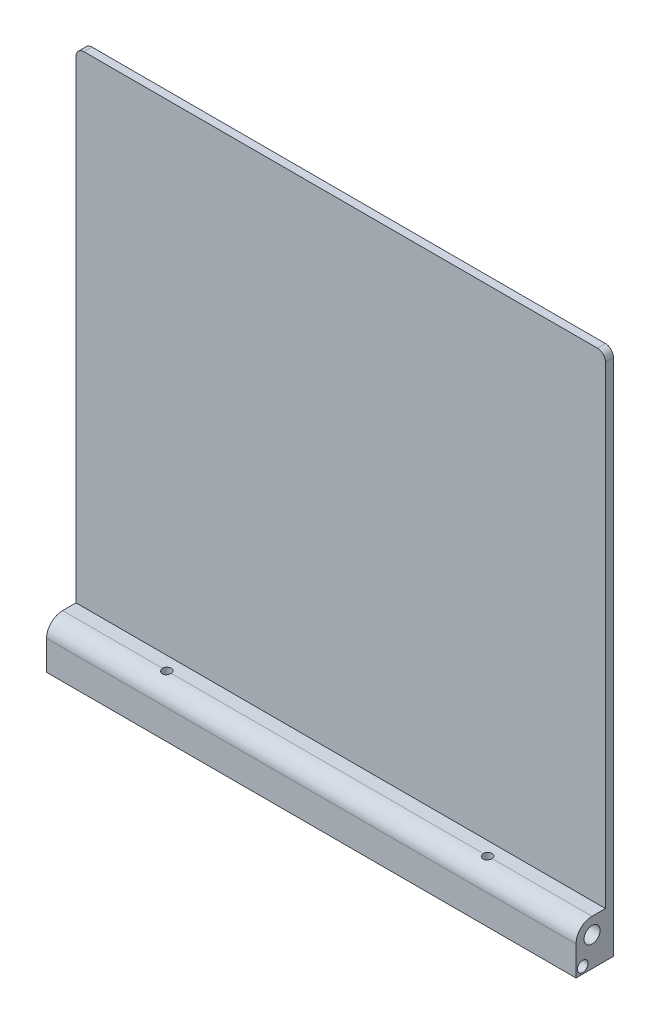
ISO-10303-21;
HEADER;
FILE_DESCRIPTION(('STEP AP214'),'2;1');
FILE_NAME('part.step','',(''),(''),'','','');
FILE_SCHEMA(('AUTOMOTIVE_DESIGN { 1 0 10303 214 1 1 1 1 }'));
ENDSEC;
DATA;
#1=APPLICATION_CONTEXT('core data for automotive mechanical design processes');
#2=APPLICATION_PROTOCOL_DEFINITION('international standard','automotive_design',2000,#1);
#3=PRODUCT_CONTEXT('',#1,'mechanical');
#4=PRODUCT('Part','Part','',(#3));
#5=PRODUCT_RELATED_PRODUCT_CATEGORY('part','',(#4));
#6=PRODUCT_DEFINITION_FORMATION('','',#4);
#7=PRODUCT_DEFINITION_CONTEXT('part definition',#1,'design');
#8=PRODUCT_DEFINITION('design','',#6,#7);
#9=PRODUCT_DEFINITION_SHAPE('','',#8);
#10=(LENGTH_UNIT() NAMED_UNIT(*) SI_UNIT(.MILLI.,.METRE.));
#11=(NAMED_UNIT(*) PLANE_ANGLE_UNIT() SI_UNIT($,.RADIAN.));
#12=(NAMED_UNIT(*) SI_UNIT($,.STERADIAN.) SOLID_ANGLE_UNIT());
#13=UNCERTAINTY_MEASURE_WITH_UNIT(LENGTH_MEASURE(1.E-05),#10,'distance_accuracy_value','');
#14=(GEOMETRIC_REPRESENTATION_CONTEXT(3) GLOBAL_UNCERTAINTY_ASSIGNED_CONTEXT((#13)) GLOBAL_UNIT_ASSIGNED_CONTEXT((#10,
#11,#12)) REPRESENTATION_CONTEXT('',''));
#15=CARTESIAN_POINT('',(0.,0.,0.));
#16=DIRECTION('',(0.,0.,1.));
#17=DIRECTION('',(1.,0.,0.));
#18=AXIS2_PLACEMENT_3D('',#15,#16,#17);
#19=CARTESIAN_POINT('',(216.439088914586,-6.,8.00000000000001));
#20=DIRECTION('',(-1.,0.,0.));
#21=DIRECTION('',(0.,0.,1.));
#22=AXIS2_PLACEMENT_3D('',#19,#20,#21);
#23=CYLINDRICAL_SURFACE('',#22,6.);
#24=CARTESIAN_POINT('',(0.,-6.,8.00000000000001));
#25=DIRECTION('',(-1.,0.,0.));
#26=DIRECTION('',(0.,0.,1.));
#27=AXIS2_PLACEMENT_3D('',#24,#25,#26);
#28=CIRCLE('',#27,6.);
#29=CARTESIAN_POINT('',(0.,-6.,14.));
#30=VERTEX_POINT('',#29);
#31=CARTESIAN_POINT('',(0.,0.,8.00000000000001));
#32=VERTEX_POINT('',#31);
#33=EDGE_CURVE('E251',#30,#32,#28,.T.);
#34=ORIENTED_EDGE('',*,*,#33,.F.);
#35=DIRECTION('',(-1.,0.,0.));
#36=VECTOR('',#35,1.);
#37=CARTESIAN_POINT('',(215.804493814765,-6.,14.));
#38=LINE('',#37,#36);
#39=CARTESIAN_POINT('',(198.,-6.,14.));
#40=VERTEX_POINT('',#39);
#41=EDGE_CURVE('E157',#40,#30,#38,.T.);
#42=ORIENTED_EDGE('',*,*,#41,.F.);
#43=CARTESIAN_POINT('',(198.,-6.,8.00000000000001));
#44=DIRECTION('',(-1.,0.,0.));
#45=DIRECTION('',(0.,0.,1.));
#46=AXIS2_PLACEMENT_3D('',#43,#44,#45);
#47=CIRCLE('',#46,6.);
#48=CARTESIAN_POINT('',(198.,0.,8.00000000000001));
#49=VERTEX_POINT('',#48);
#50=EDGE_CURVE('E245',#49,#40,#47,.F.);
#51=ORIENTED_EDGE('',*,*,#50,.F.);
#52=DIRECTION('',(-1.,0.,0.));
#53=VECTOR('',#52,1.);
#54=CARTESIAN_POINT('',(216.439088914586,0.,8.00000000000001));
#55=LINE('',#54,#53);
#56=CARTESIAN_POINT('',(160.650000000001,0.,8.00000000000001));
#57=VERTEX_POINT('',#56);
#58=EDGE_CURVE('E242',#49,#57,#55,.T.);
#59=ORIENTED_EDGE('',*,*,#58,.T.);
#60=CARTESIAN_POINT('',(157.350000000001,0.,8.00000000000001));
#61=CARTESIAN_POINT('',(157.349999349085,2.83240331525326E-06,8.04551183743026));
#62=CARTESIAN_POINT('',(157.351884234343,-0.00051846048665869,8.09100107677822));
#63=CARTESIAN_POINT('',(157.359397498983,-0.00257911264489082,8.18163817566653));
#64=CARTESIAN_POINT('',(157.365025218428,-0.00411829243840994,8.22678609396976));
#65=CARTESIAN_POINT('',(157.387437170605,-0.0102054338238871,8.36102768941026));
#66=CARTESIAN_POINT('',(157.409750588948,-0.0162233608017773,8.44919687050818));
#67=CARTESIAN_POINT('',(157.468384887187,-0.0315367611303123,8.62036467096521));
#68=CARTESIAN_POINT('',(157.504703903707,-0.0408317984636648,8.70336397644498));
#69=CARTESIAN_POINT('',(157.590259066331,-0.0617214090138262,8.86212631575357));
#70=CARTESIAN_POINT('',(157.639499218172,-0.0733166950681179,8.93788709558314));
#71=CARTESIAN_POINT('',(157.750760082946,-0.0978733295873065,9.08183007412049));
#72=CARTESIAN_POINT('',(157.813037186403,-0.110859042674939,9.14980985106851));
#73=CARTESIAN_POINT('',(157.948062331658,-0.136580582149559,9.274509565284));
#74=CARTESIAN_POINT('',(158.020812501585,-0.149316357149979,9.33122720849796));
#75=CARTESIAN_POINT('',(158.176363937181,-0.173347848442895,9.43279702883052));
#76=CARTESIAN_POINT('',(158.259325575279,-0.184612739634141,9.47741156065146));
#77=CARTESIAN_POINT('',(158.431928495845,-0.204064514089823,9.55197519180417));
#78=CARTESIAN_POINT('',(158.52156812545,-0.212252155988373,9.58192790626441));
#79=CARTESIAN_POINT('',(158.702723669719,-0.224369523897705,9.6256072656766));
#80=CARTESIAN_POINT('',(158.794143565323,-0.228396320159786,9.63970453906489));
#81=CARTESIAN_POINT('',(158.978134683162,-0.232025819556786,9.65242893409797));
#82=CARTESIAN_POINT('',(159.070705697897,-0.231629308806205,9.65105880462439));
#83=CARTESIAN_POINT('',(159.251445891706,-0.226543505517346,9.633180176991));
#84=CARTESIAN_POINT('',(159.339664025129,-0.221982542531215,9.61712420419922));
#85=CARTESIAN_POINT('',(159.512102379451,-0.209287794161005,9.57105615336394));
#86=CARTESIAN_POINT('',(159.596322301858,-0.201153742485473,9.54104303512698));
#87=CARTESIAN_POINT('',(159.759537406641,-0.182118903946736,9.46755225342328));
#88=CARTESIAN_POINT('',(159.838458524575,-0.171186357736752,9.42391867613945));
#89=CARTESIAN_POINT('',(159.988014411749,-0.147803266958054,9.32453481884693));
#90=CARTESIAN_POINT('',(160.058647606775,-0.135352434918037,9.26878224266575));
#91=CARTESIAN_POINT('',(160.192198365522,-0.109805919208269,9.14445251792482));
#92=CARTESIAN_POINT('',(160.254763319287,-0.0967028481371507,9.0754976093337));
#93=CARTESIAN_POINT('',(160.367529620892,-0.071711448314673,8.9278944479472));
#94=CARTESIAN_POINT('',(160.417727830988,-0.0598234282980691,8.8492437426718));
#95=CARTESIAN_POINT('',(160.504509221461,-0.0385183140127452,8.68390037906992));
#96=CARTESIAN_POINT('',(160.541017767157,-0.0291148450900398,8.59716676566456));
#97=CARTESIAN_POINT('',(160.598787113738,-0.0139468034544592,8.41852284388635));
#98=CARTESIAN_POINT('',(160.620070206868,-0.00817691215167189,8.32662031723512));
#99=CARTESIAN_POINT('',(160.638916115859,-0.00304028656834387,8.19491132244159));
#100=CARTESIAN_POINT('',(160.643072895872,-0.00190195021588287,8.15602229238801));
#101=CARTESIAN_POINT('',(160.648611935512,-0.00038205775457785,8.07809516769988));
#102=CARTESIAN_POINT('',(160.649998635571,7.09518498061268E-07,8.03905741229831));
#103=CARTESIAN_POINT('',(160.650000000001,0.,8.00000000000001));
#104=B_SPLINE_CURVE_WITH_KNOTS('',3,(#60,#61,#62,#63,#64,#65,#66,#67,#68,#69,#70,#71,#72,#73,
#74,#75,#76,#77,#78,#79,#80,#81,#82,#83,#84,#85,#86,#87,#88,#89,#90,#91,#92,#93,#94,#95,#96,#97,
#98,#99,#100,#101,#102,#103),.UNSPECIFIED.,.F.,.F.,(4,2,2,2,2,2,2,2,2,2,2,2,2,2,2,2,2,2,2,2,2,
4),(0.,0.136449081071721,0.272874109730397,0.544902077857917,0.816893866500146,1.08897007630706,
1.36700763137525,1.64510176366077,1.92831518768273,2.21145874524367,2.48783642218913,
2.76416498180287,3.03225558699577,3.30036617555843,3.57166593196946,3.84301713610122,
4.12378054549448,4.40461511819304,4.6869592488856,4.96888913646518,5.0861840746135,
5.20329083781439),.UNSPECIFIED.);
#105=CARTESIAN_POINT('',(157.350000000001,0.,8.00000000000001));
#106=VERTEX_POINT('',#105);
#107=EDGE_CURVE('E165',#106,#57,#104,.T.);
#108=ORIENTED_EDGE('',*,*,#107,.F.);
#109=CARTESIAN_POINT('',(40.6500000000014,0.,8.00000000000001));
#110=VERTEX_POINT('',#109);
#111=EDGE_CURVE('E246',#106,#110,#55,.T.);
#112=ORIENTED_EDGE('',*,*,#111,.T.);
#113=CARTESIAN_POINT('',(37.3500000000014,0.,8.00000000000001));
#114=CARTESIAN_POINT('',(37.3499993490854,2.83240331461787E-06,8.04551183743026));
#115=CARTESIAN_POINT('',(37.3518842343427,-0.000518460486659278,8.09100107677822));
#116=CARTESIAN_POINT('',(37.3593974989832,-0.00257911264489091,8.18163817566652));
#117=CARTESIAN_POINT('',(37.3650252184275,-0.00411829243840962,8.22678609396975));
#118=CARTESIAN_POINT('',(37.3874371706049,-0.0102054338238863,8.36102768941026));
#119=CARTESIAN_POINT('',(37.4097505889485,-0.0162233608017771,8.44919687050817));
#120=CARTESIAN_POINT('',(37.4683848871869,-0.0315367611303126,8.6203646709652));
#121=CARTESIAN_POINT('',(37.5047039037067,-0.0408317984636649,8.70336397644497));
#122=CARTESIAN_POINT('',(37.590259066331,-0.0617214090138252,8.86212631575357));
#123=CARTESIAN_POINT('',(37.6394992181721,-0.0733166950681161,8.93788709558313));
#124=CARTESIAN_POINT('',(37.7507600829463,-0.0978733295873048,9.08183007412049));
#125=CARTESIAN_POINT('',(37.813037186403,-0.110859042674939,9.14980985106851));
#126=CARTESIAN_POINT('',(37.948062331658,-0.136580582149559,9.274509565284));
#127=CARTESIAN_POINT('',(38.0208125015846,-0.149316357149978,9.33122720849795));
#128=CARTESIAN_POINT('',(38.1763639371807,-0.173347848442894,9.43279702883052));
#129=CARTESIAN_POINT('',(38.2593255752785,-0.18461273963414,9.47741156065146));
#130=CARTESIAN_POINT('',(38.4319284958445,-0.204064514089823,9.55197519180417));
#131=CARTESIAN_POINT('',(38.5215681254497,-0.212252155988372,9.58192790626441));
#132=CARTESIAN_POINT('',(38.7027236697185,-0.224369523897704,9.62560726567659));
#133=CARTESIAN_POINT('',(38.7941435653231,-0.228396320159785,9.63970453906489));
#134=CARTESIAN_POINT('',(38.9781346831618,-0.232025819556785,9.65242893409797));
#135=CARTESIAN_POINT('',(39.0707056978969,-0.231629308806204,9.65105880462439));
#136=CARTESIAN_POINT('',(39.2514458917058,-0.226543505517347,9.633180176991));
#137=CARTESIAN_POINT('',(39.3396640251285,-0.221982542531216,9.61712420419922));
#138=CARTESIAN_POINT('',(39.5121023794512,-0.209287794161006,9.57105615336395));
#139=CARTESIAN_POINT('',(39.5963223018582,-0.201153742485473,9.54104303512699));
#140=CARTESIAN_POINT('',(39.7595374066407,-0.182118903946737,9.46755225342328));
#141=CARTESIAN_POINT('',(39.8384585245753,-0.171186357736753,9.42391867613945));
#142=CARTESIAN_POINT('',(39.9880144117491,-0.147803266958057,9.32453481884694));
#143=CARTESIAN_POINT('',(40.0586476067748,-0.135352434918041,9.26878224266577));
#144=CARTESIAN_POINT('',(40.1921983655217,-0.109805919208274,9.14445251792485));
#145=CARTESIAN_POINT('',(40.254763319287,-0.0967028481371569,9.07549760933374));
#146=CARTESIAN_POINT('',(40.3675296208921,-0.0717114483146789,8.92789444794724));
#147=CARTESIAN_POINT('',(40.4177278309883,-0.0598234282980738,8.84924374267183));
#148=CARTESIAN_POINT('',(40.5045092214608,-0.0385183140127488,8.68390037906995));
#149=CARTESIAN_POINT('',(40.5410177671574,-0.0291148450900436,8.59716676566459));
#150=CARTESIAN_POINT('',(40.5987871137379,-0.0139468034544617,8.41852284388639));
#151=CARTESIAN_POINT('',(40.6200702068679,-0.00817691215167273,8.32662031723515));
#152=CARTESIAN_POINT('',(40.6389161158588,-0.00304028656834475,8.19491132244162));
#153=CARTESIAN_POINT('',(40.6430728958722,-0.00190195021588404,8.15602229238803));
#154=CARTESIAN_POINT('',(40.6486119355117,-0.000382057754579208,8.0780951676999));
#155=CARTESIAN_POINT('',(40.6499986355711,7.09518496788292E-07,8.03905741229832));
#156=CARTESIAN_POINT('',(40.6500000000014,0.,8.00000000000001));
#157=B_SPLINE_CURVE_WITH_KNOTS('',3,(#113,#114,#115,#116,#117,#118,#119,#120,#121,#122,#123,
#124,#125,#126,#127,#128,#129,#130,#131,#132,#133,#134,#135,#136,#137,#138,#139,#140,#141,#142,
#143,#144,#145,#146,#147,#148,#149,#150,#151,#152,#153,#154,#155,#156),.UNSPECIFIED.,.F.,.F.,(4,
2,2,2,2,2,2,2,2,2,2,2,2,2,2,2,2,2,2,2,2,4),(0.,0.136449081071717,0.272874109730394,
0.544902077857913,0.816893866500141,1.08897007630705,1.36700763137524,1.64510176366078,
1.92831518768272,2.21145874524365,2.4878364221891,2.76416498180281,3.03225558699575,
3.30036617555841,3.57166593196943,3.84301713610118,4.12378054549441,4.40461511819298,
4.68695924888555,4.96888913646513,5.08618407461346,5.20329083781438),.UNSPECIFIED.);
#158=CARTESIAN_POINT('',(37.3500000000014,0.,8.00000000000001));
#159=VERTEX_POINT('',#158);
#160=EDGE_CURVE('E174',#159,#110,#157,.T.);
#161=ORIENTED_EDGE('',*,*,#160,.F.);
#162=EDGE_CURVE('E247',#159,#32,#55,.T.);
#163=ORIENTED_EDGE('',*,*,#162,.T.);
#164=EDGE_LOOP('',(#34,#42,#51,#59,#108,#112,#161,#163));
#165=FACE_BOUND('',#164,.T.);
#166=ADVANCED_FACE('F36',(#165),#23,.T.);
#167=CARTESIAN_POINT('',(0.,0.,3.));
#168=DIRECTION('',(1.,0.,0.));
#169=DIRECTION('',(0.,0.,-1.));
#170=AXIS2_PLACEMENT_3D('',#167,#168,#169);
#171=PLANE('',#170);
#172=CARTESIAN_POINT('',(0.,-14.5,11.5));
#173=DIRECTION('',(1.,0.,0.));
#174=DIRECTION('',(0.,0.,-1.));
#175=AXIS2_PLACEMENT_3D('',#172,#173,#174);
#176=CIRCLE('',#175,2.);
#177=CARTESIAN_POINT('',(0.,-14.5,9.50000000000001));
#178=VERTEX_POINT('',#177);
#179=EDGE_CURVE('E431',#178,#178,#176,.T.);
#180=ORIENTED_EDGE('',*,*,#179,.T.);
#181=EDGE_LOOP('',(#180));
#182=FACE_BOUND('',#181,.T.);
#183=CARTESIAN_POINT('',(0.,-6.,8.00000000000001));
#184=DIRECTION('',(-1.,0.,0.));
#185=DIRECTION('',(0.,0.,1.));
#186=AXIS2_PLACEMENT_3D('',#183,#184,#185);
#187=CIRCLE('',#186,3.);
#188=CARTESIAN_POINT('',(0.,-6.,11.));
#189=VERTEX_POINT('',#188);
#190=EDGE_CURVE('E253',#189,#189,#187,.T.);
#191=ORIENTED_EDGE('',*,*,#190,.F.);
#192=EDGE_LOOP('',(#191));
#193=FACE_BOUND('',#192,.T.);
#194=DIRECTION('',(0.,-1.,0.));
#195=VECTOR('',#194,1.);
#196=CARTESIAN_POINT('',(0.,0.,0.));
#197=LINE('',#196,#195);
#198=CARTESIAN_POINT('',(0.,177.,0.));
#199=VERTEX_POINT('',#198);
#200=CARTESIAN_POINT('',(0.,-17.,0.));
#201=VERTEX_POINT('',#200);
#202=EDGE_CURVE('E121',#199,#201,#197,.T.);
#203=ORIENTED_EDGE('',*,*,#202,.T.);
#204=DIRECTION('',(0.,0.,1.));
#205=VECTOR('',#204,1.);
#206=CARTESIAN_POINT('',(0.,-17.,0.));
#207=LINE('',#206,#205);
#208=CARTESIAN_POINT('',(0.,-17.,14.));
#209=VERTEX_POINT('',#208);
#210=EDGE_CURVE('E126',#201,#209,#207,.T.);
#211=ORIENTED_EDGE('',*,*,#210,.T.);
#212=DIRECTION('',(0.,1.,0.));
#213=VECTOR('',#212,1.);
#214=CARTESIAN_POINT('',(0.,-17.,14.));
#215=LINE('',#214,#213);
#216=EDGE_CURVE('E146',#209,#30,#215,.T.);
#217=ORIENTED_EDGE('',*,*,#216,.T.);
#218=ORIENTED_EDGE('',*,*,#33,.T.);
#219=DIRECTION('',(0.,0.,-1.));
#220=VECTOR('',#219,1.);
#221=CARTESIAN_POINT('',(0.,0.,0.));
#222=LINE('',#221,#220);
#223=CARTESIAN_POINT('',(0.,0.,3.));
#224=VERTEX_POINT('',#223);
#225=EDGE_CURVE('E248',#32,#224,#222,.T.);
#226=ORIENTED_EDGE('',*,*,#225,.T.);
#227=DIRECTION('',(0.,-1.,0.));
#228=VECTOR('',#227,1.);
#229=CARTESIAN_POINT('',(0.,0.,3.));
#230=LINE('',#229,#228);
#231=CARTESIAN_POINT('',(0.,177.,3.));
#232=VERTEX_POINT('',#231);
#233=EDGE_CURVE('E233',#232,#224,#230,.T.);
#234=ORIENTED_EDGE('',*,*,#233,.F.);
#235=DIRECTION('',(0.,0.,-1.));
#236=VECTOR('',#235,1.);
#237=CARTESIAN_POINT('',(0.,177.,3.));
#238=LINE('',#237,#236);
#239=EDGE_CURVE('E11',#232,#199,#238,.T.);
#240=ORIENTED_EDGE('',*,*,#239,.T.);
#241=EDGE_LOOP('',(#203,#211,#217,#218,#226,#234,#240));
#242=FACE_BOUND('',#241,.T.);
#243=ADVANCED_FACE('F123',(#182,#193,#242),#171,.F.);
#244=CARTESIAN_POINT('',(198.,0.,3.));
#245=DIRECTION('',(-1.,0.,0.));
#246=DIRECTION('',(0.,0.,1.));
#247=AXIS2_PLACEMENT_3D('',#244,#245,#246);
#248=PLANE('',#247);
#249=CARTESIAN_POINT('',(198.,-14.5,11.5));
#250=DIRECTION('',(1.,0.,0.));
#251=DIRECTION('',(0.,0.,-1.));
#252=AXIS2_PLACEMENT_3D('',#249,#250,#251);
#253=CIRCLE('',#252,2.);
#254=CARTESIAN_POINT('',(198.,-14.5,9.50000000000001));
#255=VERTEX_POINT('',#254);
#256=EDGE_CURVE('E151',#255,#255,#253,.T.);
#257=ORIENTED_EDGE('',*,*,#256,.F.);
#258=EDGE_LOOP('',(#257));
#259=FACE_BOUND('',#258,.T.);
#260=DIRECTION('',(0.,1.,0.));
#261=VECTOR('',#260,1.);
#262=CARTESIAN_POINT('',(198.,0.,0.));
#263=LINE('',#262,#261);
#264=CARTESIAN_POINT('',(198.,-17.,0.));
#265=VERTEX_POINT('',#264);
#266=CARTESIAN_POINT('',(198.,177.,0.));
#267=VERTEX_POINT('',#266);
#268=EDGE_CURVE('E129',#265,#267,#263,.T.);
#269=ORIENTED_EDGE('',*,*,#268,.T.);
#270=DIRECTION('',(0.,0.,-1.));
#271=VECTOR('',#270,1.);
#272=CARTESIAN_POINT('',(198.,177.,3.));
#273=LINE('',#272,#271);
#274=CARTESIAN_POINT('',(198.,177.,3.));
#275=VERTEX_POINT('',#274);
#276=EDGE_CURVE('E59',#267,#275,#273,.F.);
#277=ORIENTED_EDGE('',*,*,#276,.T.);
#278=DIRECTION('',(0.,1.,0.));
#279=VECTOR('',#278,1.);
#280=CARTESIAN_POINT('',(198.,0.,3.));
#281=LINE('',#280,#279);
#282=CARTESIAN_POINT('',(198.,0.,3.));
#283=VERTEX_POINT('',#282);
#284=EDGE_CURVE('E223',#283,#275,#281,.T.);
#285=ORIENTED_EDGE('',*,*,#284,.F.);
#286=DIRECTION('',(0.,0.,1.));
#287=VECTOR('',#286,1.);
#288=CARTESIAN_POINT('',(198.,0.,0.));
#289=LINE('',#288,#287);
#290=EDGE_CURVE('E241',#283,#49,#289,.T.);
#291=ORIENTED_EDGE('',*,*,#290,.T.);
#292=ORIENTED_EDGE('',*,*,#50,.T.);
#293=DIRECTION('',(0.,-1.,0.));
#294=VECTOR('',#293,1.);
#295=CARTESIAN_POINT('',(198.,-17.,14.));
#296=LINE('',#295,#294);
#297=CARTESIAN_POINT('',(198.,-17.,14.));
#298=VERTEX_POINT('',#297);
#299=EDGE_CURVE('E154',#40,#298,#296,.T.);
#300=ORIENTED_EDGE('',*,*,#299,.T.);
#301=DIRECTION('',(0.,0.,-1.));
#302=VECTOR('',#301,1.);
#303=CARTESIAN_POINT('',(198.,-17.,0.));
#304=LINE('',#303,#302);
#305=EDGE_CURVE('E140',#298,#265,#304,.T.);
#306=ORIENTED_EDGE('',*,*,#305,.T.);
#307=EDGE_LOOP('',(#269,#277,#285,#291,#292,#300,#306));
#308=FACE_BOUND('',#307,.T.);
#309=CARTESIAN_POINT('',(198.,-6.,8.00000000000001));
#310=DIRECTION('',(-1.,0.,0.));
#311=DIRECTION('',(0.,0.,1.));
#312=AXIS2_PLACEMENT_3D('',#309,#310,#311);
#313=CIRCLE('',#312,3.);
#314=CARTESIAN_POINT('',(198.,-6.,11.));
#315=VERTEX_POINT('',#314);
#316=EDGE_CURVE('E130',#315,#315,#313,.F.);
#317=ORIENTED_EDGE('',*,*,#316,.F.);
#318=EDGE_LOOP('',(#317));
#319=FACE_BOUND('',#318,.T.);
#320=ADVANCED_FACE('F259',(#259,#308,#319),#248,.F.);
#321=CARTESIAN_POINT('',(0.,180.,3.));
#322=DIRECTION('',(0.,-1.,0.));
#323=DIRECTION('',(0.,0.,-1.));
#324=AXIS2_PLACEMENT_3D('',#321,#322,#323);
#325=PLANE('',#324);
#326=DIRECTION('',(-1.,0.,0.));
#327=VECTOR('',#326,1.);
#328=CARTESIAN_POINT('',(0.,180.,3.));
#329=LINE('',#328,#327);
#330=CARTESIAN_POINT('',(195.,180.,3.));
#331=VERTEX_POINT('',#330);
#332=CARTESIAN_POINT('',(3.,180.,3.));
#333=VERTEX_POINT('',#332);
#334=EDGE_CURVE('E212',#331,#333,#329,.T.);
#335=ORIENTED_EDGE('',*,*,#334,.F.);
#336=DIRECTION('',(0.,0.,-1.));
#337=VECTOR('',#336,1.);
#338=CARTESIAN_POINT('',(195.,180.,3.));
#339=LINE('',#338,#337);
#340=CARTESIAN_POINT('',(195.,180.,0.));
#341=VERTEX_POINT('',#340);
#342=EDGE_CURVE('E211',#331,#341,#339,.T.);
#343=ORIENTED_EDGE('',*,*,#342,.T.);
#344=DIRECTION('',(-1.,0.,0.));
#345=VECTOR('',#344,1.);
#346=CARTESIAN_POINT('',(0.,180.,0.));
#347=LINE('',#346,#345);
#348=CARTESIAN_POINT('',(3.,180.,0.));
#349=VERTEX_POINT('',#348);
#350=EDGE_CURVE('E202',#341,#349,#347,.T.);
#351=ORIENTED_EDGE('',*,*,#350,.T.);
#352=DIRECTION('',(0.,0.,-1.));
#353=VECTOR('',#352,1.);
#354=CARTESIAN_POINT('',(3.,180.,3.));
#355=LINE('',#354,#353);
#356=EDGE_CURVE('E209',#349,#333,#355,.F.);
#357=ORIENTED_EDGE('',*,*,#356,.T.);
#358=EDGE_LOOP('',(#335,#343,#351,#357));
#359=FACE_BOUND('',#358,.T.);
#360=ADVANCED_FACE('F227',(#359),#325,.F.);
#361=CARTESIAN_POINT('',(0.,0.,3.));
#362=DIRECTION('',(0.,0.,-1.));
#363=DIRECTION('',(-1.,0.,0.));
#364=AXIS2_PLACEMENT_3D('',#361,#362,#363);
#365=PLANE('',#364);
#366=ORIENTED_EDGE('',*,*,#284,.T.);
#367=CARTESIAN_POINT('',(195.,177.,3.));
#368=DIRECTION('',(0.,0.,-1.));
#369=DIRECTION('',(-1.,0.,0.));
#370=AXIS2_PLACEMENT_3D('',#367,#368,#369);
#371=CIRCLE('',#370,3.);
#372=EDGE_CURVE('E44',#275,#331,#371,.F.);
#373=ORIENTED_EDGE('',*,*,#372,.T.);
#374=ORIENTED_EDGE('',*,*,#334,.T.);
#375=CARTESIAN_POINT('',(3.,177.,3.));
#376=DIRECTION('',(0.,0.,-1.));
#377=DIRECTION('',(-1.,0.,0.));
#378=AXIS2_PLACEMENT_3D('',#375,#376,#377);
#379=CIRCLE('',#378,3.);
#380=EDGE_CURVE('E51',#333,#232,#379,.F.);
#381=ORIENTED_EDGE('',*,*,#380,.T.);
#382=ORIENTED_EDGE('',*,*,#233,.T.);
#383=DIRECTION('',(1.,0.,0.));
#384=VECTOR('',#383,1.);
#385=CARTESIAN_POINT('',(0.,0.,3.));
#386=LINE('',#385,#384);
#387=EDGE_CURVE('E234',#224,#283,#386,.T.);
#388=ORIENTED_EDGE('',*,*,#387,.T.);
#389=EDGE_LOOP('',(#366,#373,#374,#381,#382,#388));
#390=FACE_BOUND('',#389,.T.);
#391=ADVANCED_FACE('F222',(#390),#365,.F.);
#392=CARTESIAN_POINT('',(0.,0.,0.));
#393=DIRECTION('',(0.,0.,-1.));
#394=DIRECTION('',(-1.,0.,0.));
#395=AXIS2_PLACEMENT_3D('',#392,#393,#394);
#396=PLANE('',#395);
#397=CARTESIAN_POINT('',(195.,177.,0.));
#398=DIRECTION('',(0.,0.,-1.));
#399=DIRECTION('',(-1.,0.,0.));
#400=AXIS2_PLACEMENT_3D('',#397,#398,#399);
#401=CIRCLE('',#400,3.);
#402=EDGE_CURVE('E217',#341,#267,#401,.T.);
#403=ORIENTED_EDGE('',*,*,#402,.T.);
#404=ORIENTED_EDGE('',*,*,#268,.F.);
#405=DIRECTION('',(1.,0.,0.));
#406=VECTOR('',#405,1.);
#407=CARTESIAN_POINT('',(0.,-17.,0.));
#408=LINE('',#407,#406);
#409=EDGE_CURVE('E133',#201,#265,#408,.T.);
#410=ORIENTED_EDGE('',*,*,#409,.F.);
#411=ORIENTED_EDGE('',*,*,#202,.F.);
#412=CARTESIAN_POINT('',(3.,177.,0.));
#413=DIRECTION('',(0.,0.,-1.));
#414=DIRECTION('',(-1.,0.,0.));
#415=AXIS2_PLACEMENT_3D('',#412,#413,#414);
#416=CIRCLE('',#415,3.);
#417=EDGE_CURVE('E215',#199,#349,#416,.T.);
#418=ORIENTED_EDGE('',*,*,#417,.T.);
#419=ORIENTED_EDGE('',*,*,#350,.F.);
#420=EDGE_LOOP('',(#403,#404,#410,#411,#418,#419));
#421=FACE_BOUND('',#420,.T.);
#422=ADVANCED_FACE('F135',(#421),#396,.T.);
#423=CARTESIAN_POINT('',(216.439088914586,0.,0.));
#424=DIRECTION('',(0.,1.,0.));
#425=DIRECTION('',(0.,0.,1.));
#426=AXIS2_PLACEMENT_3D('',#423,#424,#425);
#427=PLANE('',#426);
#428=CARTESIAN_POINT('',(39.0000000000014,0.,8.00000000000108));
#429=DIRECTION('',(0.,1.,0.));
#430=DIRECTION('',(0.,0.,1.));
#431=AXIS2_PLACEMENT_3D('',#428,#429,#430);
#432=CIRCLE('',#431,1.65);
#433=EDGE_CURVE('E161',#110,#159,#432,.T.);
#434=ORIENTED_EDGE('',*,*,#433,.F.);
#435=ORIENTED_EDGE('',*,*,#111,.F.);
#436=CARTESIAN_POINT('',(159.000000000001,0.,8.00000000000107));
#437=DIRECTION('',(0.,1.,0.));
#438=DIRECTION('',(0.,0.,1.));
#439=AXIS2_PLACEMENT_3D('',#436,#437,#438);
#440=CIRCLE('',#439,1.65000000000002);
#441=EDGE_CURVE('E139',#57,#106,#440,.T.);
#442=ORIENTED_EDGE('',*,*,#441,.F.);
#443=ORIENTED_EDGE('',*,*,#58,.F.);
#444=ORIENTED_EDGE('',*,*,#290,.F.);
#445=ORIENTED_EDGE('',*,*,#387,.F.);
#446=ORIENTED_EDGE('',*,*,#225,.F.);
#447=ORIENTED_EDGE('',*,*,#162,.F.);
#448=EDGE_LOOP('',(#434,#435,#442,#443,#444,#445,#446,#447));
#449=FACE_BOUND('',#448,.T.);
#450=ADVANCED_FACE('F270',(#449),#427,.T.);
#451=CARTESIAN_POINT('',(216.439088914586,-6.,8.00000000000001));
#452=DIRECTION('',(-1.,0.,0.));
#453=DIRECTION('',(0.,0.,1.));
#454=AXIS2_PLACEMENT_3D('',#451,#452,#453);
#455=CYLINDRICAL_SURFACE('',#454,3.);
#456=ORIENTED_EDGE('',*,*,#316,.T.);
#457=EDGE_LOOP('',(#456));
#458=FACE_BOUND('',#457,.T.);
#459=CARTESIAN_POINT('',(39.0000000000014,-3.49450603672719,9.65000000000108));
#460=CARTESIAN_POINT('',(39.0845622441256,-3.49449709270925,9.64999358115623));
#461=CARTESIAN_POINT('',(39.1691984196451,-3.49015721695437,9.64345412095617));
#462=CARTESIAN_POINT('',(39.3357580106574,-3.47347694527976,9.61768357796238));
#463=CARTESIAN_POINT('',(39.4176766077384,-3.46112306186729,9.59843109830629));
#464=CARTESIAN_POINT('',(39.5760581583429,-3.43030485576006,9.54839133504233));
#465=CARTESIAN_POINT('',(39.652551663641,-3.41187871746298,9.51767597794628));
#466=CARTESIAN_POINT('',(39.7992707493245,-3.37105426039359,9.44580368027431));
#467=CARTESIAN_POINT('',(39.86949501938,-3.34865511413322,9.40464456372819));
#468=CARTESIAN_POINT('',(40.0094930204873,-3.29965772830572,9.30818987552223));
#469=CARTESIAN_POINT('',(40.0785038569216,-3.27286389707212,9.2518859756865));
#470=CARTESIAN_POINT('',(40.2067154247574,-3.21966597877721,9.12882249865193));
#471=CARTESIAN_POINT('',(40.2659102794468,-3.19326213375017,9.06205670422409));
#472=CARTESIAN_POINT('',(40.3778127875262,-3.14111744666084,8.91298403880362));
#473=CARTESIAN_POINT('',(40.4295270891269,-3.11562817127708,8.82983500932754));
#474=CARTESIAN_POINT('',(40.5178779061816,-3.07083622535249,8.65434955639918));
#475=CARTESIAN_POINT('',(40.5545259108971,-3.05152884311608,8.56202020066096));
#476=CARTESIAN_POINT('',(40.608493984801,-3.02270617669625,8.37892285434443));
#477=CARTESIAN_POINT('',(40.6271681432733,-3.01250999379457,8.28866376218955));
#478=CARTESIAN_POINT('',(40.6491747783533,-3.00046879782476,8.10576884897313));
#479=CARTESIAN_POINT('',(40.6525188859999,-2.99861745347504,8.01313488342847));
#480=CARTESIAN_POINT('',(40.6441598762645,-3.00320873616286,7.83854305725778));
#481=CARTESIAN_POINT('',(40.6339956989633,-3.00880319411728,7.75648296395873));
#482=CARTESIAN_POINT('',(40.6017438606681,-3.02629860909347,7.59545106528745));
#483=CARTESIAN_POINT('',(40.5796552840274,-3.03820005041238,7.51647949757531));
#484=CARTESIAN_POINT('',(40.5241824045513,-3.06741207866691,7.3627205702147));
#485=CARTESIAN_POINT('',(40.4906790487465,-3.08477952262424,7.28798741293562));
#486=CARTESIAN_POINT('',(40.4135685538591,-3.12344578060551,7.14505825869577));
#487=CARTESIAN_POINT('',(40.3699581828163,-3.1447458517372,7.07686436270299));
#488=CARTESIAN_POINT('',(40.2685152499599,-3.1920818561752,6.94108282808258));
#489=CARTESIAN_POINT('',(40.2096560691288,-3.2183807982742,6.87435382804526));
#490=CARTESIAN_POINT('',(40.0820757945517,-3.27144362000169,6.75120622016277));
#491=CARTESIAN_POINT('',(40.0133445587429,-3.29820795258559,6.69479835294653));
#492=CARTESIAN_POINT('',(39.860702045772,-3.35183739258562,6.5889524285302));
#493=CARTESIAN_POINT('',(39.775987825025,-3.37850506442409,6.5405610191552));
#494=CARTESIAN_POINT('',(39.5979123412458,-3.42557330545121,6.45903927559911));
#495=CARTESIAN_POINT('',(39.5045612261064,-3.44598111093299,6.42589129797835));
#496=CARTESIAN_POINT('',(39.3196175660875,-3.47571131114557,6.37867519252511));
#497=CARTESIAN_POINT('',(39.2284922928204,-3.48579611824175,6.36328191851038));
#498=CARTESIAN_POINT('',(39.044438567397,-3.49578867715998,6.34802399451809));
#499=CARTESIAN_POINT('',(38.9515122989963,-3.49570806671375,6.34814158715556));
#500=CARTESIAN_POINT('',(38.781019303226,-3.4861870836415,6.36268933002527));
#501=CARTESIAN_POINT('',(38.7031832372133,-3.4781088171916,6.37503672421015));
#502=CARTESIAN_POINT('',(38.550905157293,-3.45569101683707,6.41036907454818));
#503=CARTESIAN_POINT('',(38.4764646488042,-3.44134873501758,6.43335869952878));
#504=CARTESIAN_POINT('',(38.3294315856607,-3.40735298946975,6.49025912465952));
#505=CARTESIAN_POINT('',(38.2570491793063,-3.38750113804085,6.52458941328384));
#506=CARTESIAN_POINT('',(38.1186384670183,-3.34482474371761,6.6028491192572));
#507=CARTESIAN_POINT('',(38.0526133280187,-3.32199873240428,6.64678328559649));
#508=CARTESIAN_POINT('',(37.9178240171682,-3.27161254019689,6.7510961527158));
#509=CARTESIAN_POINT('',(37.8502833445476,-3.24387528789408,6.81297743965268));
#510=CARTESIAN_POINT('',(37.7260553654188,-3.18978533522668,6.9474096575205));
#511=CARTESIAN_POINT('',(37.6693744233953,-3.16343345330008,7.01996680140781));
#512=CARTESIAN_POINT('',(37.565816435223,-3.11344113825623,7.17840856798357));
#513=CARTESIAN_POINT('',(37.5195801922196,-3.09000523715085,7.26478163550579));
#514=CARTESIAN_POINT('',(37.4427856946255,-3.0501977510135,7.4457304638209));
#515=CARTESIAN_POINT('',(37.4122111394398,-3.0338188239569,7.54029757591576));
#516=CARTESIAN_POINT('',(37.3706938816095,-3.01137674932014,7.72458220200568));
#517=CARTESIAN_POINT('',(37.358069030657,-3.00443294567565,7.81381287057578));
#518=CARTESIAN_POINT('',(37.3475681065668,-2.99866563141353,7.99338323691222));
#519=CARTESIAN_POINT('',(37.3496842641817,-2.99983784324861,8.08372232542616));
#520=CARTESIAN_POINT('',(37.3676699284632,-3.00968957572484,8.25435836629808));
#521=CARTESIAN_POINT('',(37.3822936667957,-3.01768895328183,8.33483136304888));
#522=CARTESIAN_POINT('',(37.4229648219918,-3.03955298974637,8.49198583387791));
#523=CARTESIAN_POINT('',(37.4490136019567,-3.05341834850662,8.56866685432717));
#524=CARTESIAN_POINT('',(37.512612632041,-3.08640124814582,8.71908027948212));
#525=CARTESIAN_POINT('',(37.5505255940464,-3.10568212059096,8.79262229620643));
#526=CARTESIAN_POINT('',(37.636325501489,-3.14768349385245,8.93254240527049));
#527=CARTESIAN_POINT('',(37.6842164806009,-3.17040538470382,8.99891758384575));
#528=CARTESIAN_POINT('',(37.7949260016517,-3.22025482875027,9.13072210629279));
#529=CARTESIAN_POINT('',(37.858827833727,-3.24758854059231,9.19516495605952));
#530=CARTESIAN_POINT('',(37.9965071375533,-3.30176121462997,9.31290440702928));
#531=CARTESIAN_POINT('',(38.0702964652747,-3.32859953815892,9.36618742691478));
#532=CARTESIAN_POINT('',(38.2317240000528,-3.38054891911129,9.46345962344371));
#533=CARTESIAN_POINT('',(38.319956398594,-3.40542700910459,9.50659692748136));
#534=CARTESIAN_POINT('',(38.5041788004101,-3.44747114415782,9.57680093269463));
#535=CARTESIAN_POINT('',(38.6001429528296,-3.46466172463311,9.60391885150263));
#536=CARTESIAN_POINT('',(38.7478087830599,-3.4823307458686,9.63139486596199));
#537=CARTESIAN_POINT('',(38.7978747641614,-3.48686937386928,9.63835444050038));
#538=CARTESIAN_POINT('',(38.8986183124089,-3.49295966763606,9.64765888075723));
#539=CARTESIAN_POINT('',(38.9492958659705,-3.49451139962513,9.65000384878694));
#540=CARTESIAN_POINT('',(39.0000000000014,-3.49450603672719,9.65000000000108));
#541=B_SPLINE_CURVE_WITH_KNOTS('',3,(#459,#460,#461,#462,#463,#464,#465,#466,#467,#468,#469,
#470,#471,#472,#473,#474,#475,#476,#477,#478,#479,#480,#481,#482,#483,#484,#485,#486,#487,#488,
#489,#490,#491,#492,#493,#494,#495,#496,#497,#498,#499,#500,#501,#502,#503,#504,#505,#506,#507,
#508,#509,#510,#511,#512,#513,#514,#515,#516,#517,#518,#519,#520,#521,#522,#523,#524,#525,#526,
#527,#528,#529,#530,#531,#532,#533,#534,#535,#536,#537,#538,#539,#540),.UNSPECIFIED.,.T.,.F.,(4,
2,2,2,2,2,2,2,2,2,2,2,2,2,2,2,2,2,2,2,2,2,2,2,2,2,2,2,2,2,2,2,2,2,2,2,2,2,2,2,4),(0.,
0.253471464978883,0.507370630471886,0.7597027237183,1.01208743389975,1.28998079678307,
1.56803993512362,1.86997289364907,2.17167517502769,2.44828286528195,2.72468065617503,
2.97213663093987,3.21961160997036,3.46975098230544,3.71997045333209,3.99717687977863,
4.27467015892951,4.57652503396555,4.87802964361044,5.15517475627447,5.43200258623565,
5.66859462056201,5.90529054812099,6.15196333618112,6.39875837770531,6.68465599353138,
6.9707206542104,7.27125286686233,7.57147164850528,7.84111747203323,8.11062118950815,
8.35604451303938,8.60149712555482,8.85533990697392,9.10928550569663,9.39243346006442,
9.67592402360686,9.97823556729937,10.2795752459722,10.431561941938,10.5835452681421),.UNSPECIFIED.);
#542=CARTESIAN_POINT('',(39.0000000000014,-3.49450603672719,9.65000000000108));
#543=VERTEX_POINT('',#542);
#544=EDGE_CURVE('E173',#543,#543,#541,.T.);
#545=ORIENTED_EDGE('',*,*,#544,.T.);
#546=EDGE_LOOP('',(#545));
#547=FACE_BOUND('',#546,.T.);
#548=CARTESIAN_POINT('',(159.000000000001,-3.49450603672719,9.65000000000108));
#549=CARTESIAN_POINT('',(159.084562244126,-3.49449709270925,9.64999358115623));
#550=CARTESIAN_POINT('',(159.169198419645,-3.49015721695437,9.64345412095617));
#551=CARTESIAN_POINT('',(159.335758010657,-3.47347694527976,9.61768357796238));
#552=CARTESIAN_POINT('',(159.417676607738,-3.46112306186729,9.59843109830629));
#553=CARTESIAN_POINT('',(159.576058158343,-3.43030485576006,9.54839133504233));
#554=CARTESIAN_POINT('',(159.652551663641,-3.41187871746298,9.51767597794628));
#555=CARTESIAN_POINT('',(159.799270749325,-3.37105426039359,9.44580368027431));
#556=CARTESIAN_POINT('',(159.86949501938,-3.34865511413322,9.40464456372819));
#557=CARTESIAN_POINT('',(160.009493020487,-3.29965772830572,9.30818987552223));
#558=CARTESIAN_POINT('',(160.078503856922,-3.27286389707212,9.25188597568649));
#559=CARTESIAN_POINT('',(160.206715424757,-3.2196659787772,9.12882249865192));
#560=CARTESIAN_POINT('',(160.265910279447,-3.19326213375017,9.06205670422408));
#561=CARTESIAN_POINT('',(160.377812787526,-3.14111744666084,8.91298403880362));
#562=CARTESIAN_POINT('',(160.429527089127,-3.11562817127708,8.82983500932754));
#563=CARTESIAN_POINT('',(160.517877906182,-3.07083622535249,8.65434955639918));
#564=CARTESIAN_POINT('',(160.554525910897,-3.05152884311608,8.56202020066096));
#565=CARTESIAN_POINT('',(160.608493984801,-3.02270617669625,8.37892285434443));
#566=CARTESIAN_POINT('',(160.627168143273,-3.01250999379457,8.28866376218955));
#567=CARTESIAN_POINT('',(160.649174778353,-3.00046879782476,8.10576884897313));
#568=CARTESIAN_POINT('',(160.652518886,-2.99861745347504,8.01313488342848));
#569=CARTESIAN_POINT('',(160.644159876264,-3.00320873616286,7.83854305725778));
#570=CARTESIAN_POINT('',(160.633995698963,-3.00880319411728,7.75648296395873));
#571=CARTESIAN_POINT('',(160.601743860668,-3.02629860909348,7.59545106528744));
#572=CARTESIAN_POINT('',(160.579655284027,-3.03820005041238,7.5164794975753));
#573=CARTESIAN_POINT('',(160.524182404551,-3.06741207866692,7.36272057021469));
#574=CARTESIAN_POINT('',(160.490679048747,-3.08477952262424,7.2879874129356));
#575=CARTESIAN_POINT('',(160.413568553859,-3.12344578060551,7.14505825869576));
#576=CARTESIAN_POINT('',(160.369958182816,-3.1447458517372,7.07686436270298));
#577=CARTESIAN_POINT('',(160.26851524996,-3.19208185617521,6.94108282808258));
#578=CARTESIAN_POINT('',(160.209656069129,-3.2183807982742,6.87435382804525));
#579=CARTESIAN_POINT('',(160.082075794552,-3.2714436200017,6.75120622016276));
#580=CARTESIAN_POINT('',(160.013344558743,-3.2982079525856,6.69479835294652));
#581=CARTESIAN_POINT('',(159.860702045772,-3.35183739258563,6.58895242853018));
#582=CARTESIAN_POINT('',(159.775987825025,-3.3785050644241,6.54056101915518));
#583=CARTESIAN_POINT('',(159.597912341246,-3.42557330545123,6.45903927559909));
#584=CARTESIAN_POINT('',(159.504561226106,-3.445981110933,6.42589129797833));
#585=CARTESIAN_POINT('',(159.319617566087,-3.47571131114559,6.37867519252508));
#586=CARTESIAN_POINT('',(159.22849229282,-3.48579611824176,6.36328191851035));
#587=CARTESIAN_POINT('',(159.044438567397,-3.49578867716,6.34802399451806));
#588=CARTESIAN_POINT('',(158.951512298996,-3.49570806671377,6.34814158715553));
#589=CARTESIAN_POINT('',(158.781019303226,-3.48618708364152,6.36268933002524));
#590=CARTESIAN_POINT('',(158.703183237213,-3.47810881719161,6.37503672421013));
#591=CARTESIAN_POINT('',(158.550905157293,-3.45569101683709,6.41036907454816));
#592=CARTESIAN_POINT('',(158.476464648804,-3.4413487350176,6.43335869952875));
#593=CARTESIAN_POINT('',(158.329431585661,-3.40735298946977,6.49025912465949));
#594=CARTESIAN_POINT('',(158.257049179306,-3.38750113804087,6.52458941328381));
#595=CARTESIAN_POINT('',(158.118638467018,-3.34482474371763,6.60284911925717));
#596=CARTESIAN_POINT('',(158.052613328019,-3.3219987324043,6.64678328559646));
#597=CARTESIAN_POINT('',(157.917824017168,-3.2716125401969,6.75109615271578));
#598=CARTESIAN_POINT('',(157.850283344548,-3.24387528789409,6.81297743965267));
#599=CARTESIAN_POINT('',(157.726055365419,-3.18978533522669,6.94740965752048));
#600=CARTESIAN_POINT('',(157.669374423395,-3.16343345330009,7.01996680140778));
#601=CARTESIAN_POINT('',(157.565816435223,-3.11344113825624,7.17840856798353));
#602=CARTESIAN_POINT('',(157.51958019222,-3.09000523715086,7.26478163550576));
#603=CARTESIAN_POINT('',(157.442785694625,-3.0501977510135,7.44573046382087));
#604=CARTESIAN_POINT('',(157.41221113944,-3.0338188239569,7.54029757591573));
#605=CARTESIAN_POINT('',(157.37069388161,-3.01137674932015,7.72458220200565));
#606=CARTESIAN_POINT('',(157.358069030657,-3.00443294567565,7.81381287057576));
#607=CARTESIAN_POINT('',(157.347568106567,-2.99866563141353,7.9933832369122));
#608=CARTESIAN_POINT('',(157.349684264182,-2.99983784324861,8.08372232542615));
#609=CARTESIAN_POINT('',(157.367669928463,-3.00968957572484,8.25435836629806));
#610=CARTESIAN_POINT('',(157.382293666796,-3.01768895328183,8.33483136304886));
#611=CARTESIAN_POINT('',(157.422964821992,-3.03955298974637,8.49198583387789));
#612=CARTESIAN_POINT('',(157.449013601957,-3.05341834850661,8.56866685432715));
#613=CARTESIAN_POINT('',(157.512612632041,-3.08640124814581,8.7190802794821));
#614=CARTESIAN_POINT('',(157.550525594046,-3.10568212059096,8.79262229620642));
#615=CARTESIAN_POINT('',(157.636325501489,-3.14768349385245,8.93254240527047));
#616=CARTESIAN_POINT('',(157.684216480601,-3.17040538470381,8.99891758384574));
#617=CARTESIAN_POINT('',(157.794926001652,-3.22025482875026,9.13072210629277));
#618=CARTESIAN_POINT('',(157.858827833727,-3.2475885405923,9.19516495605949));
#619=CARTESIAN_POINT('',(157.996507137553,-3.30176121462996,9.31290440702925));
#620=CARTESIAN_POINT('',(158.070296465275,-3.32859953815891,9.36618742691476));
#621=CARTESIAN_POINT('',(158.231724000053,-3.38054891911128,9.4634596234437));
#622=CARTESIAN_POINT('',(158.319956398594,-3.40542700910458,9.50659692748135));
#623=CARTESIAN_POINT('',(158.50417880041,-3.44747114415782,9.57680093269463));
#624=CARTESIAN_POINT('',(158.60014295283,-3.46466172463311,9.60391885150263));
#625=CARTESIAN_POINT('',(158.74780878306,-3.4823307458686,9.63139486596199));
#626=CARTESIAN_POINT('',(158.797874764161,-3.48686937386928,9.63835444050038));
#627=CARTESIAN_POINT('',(158.898618312409,-3.49295966763606,9.64765888075723));
#628=CARTESIAN_POINT('',(158.94929586597,-3.49451139962513,9.65000384878694));
#629=CARTESIAN_POINT('',(159.000000000001,-3.49450603672719,9.65000000000108));
#630=B_SPLINE_CURVE_WITH_KNOTS('',3,(#548,#549,#550,#551,#552,#553,#554,#555,#556,#557,#558,
#559,#560,#561,#562,#563,#564,#565,#566,#567,#568,#569,#570,#571,#572,#573,#574,#575,#576,#577,
#578,#579,#580,#581,#582,#583,#584,#585,#586,#587,#588,#589,#590,#591,#592,#593,#594,#595,#596,
#597,#598,#599,#600,#601,#602,#603,#604,#605,#606,#607,#608,#609,#610,#611,#612,#613,#614,#615,
#616,#617,#618,#619,#620,#621,#622,#623,#624,#625,#626,#627,#628,#629),.UNSPECIFIED.,.T.,.F.,(4,
2,2,2,2,2,2,2,2,2,2,2,2,2,2,2,2,2,2,2,2,2,2,2,2,2,2,2,2,2,2,2,2,2,2,2,2,2,2,2,4),(0.,
0.253471464978876,0.507370630471892,0.7597027237183,1.01208743389976,1.28998079678309,
1.56803993512362,1.86997289364907,2.1716751750277,2.44828286528195,2.72468065617504,
2.97213663093988,3.21961160997038,3.46975098230547,3.71997045333212,3.99717687977865,
4.27467015892952,4.57652503396558,4.87802964361049,5.15517475627451,5.43200258623568,
5.66859462056206,5.90529054812103,6.15196333618117,6.39875837770536,6.68465599353144,
6.97072065421045,7.27125286686237,7.57147164850534,7.84111747203329,8.11062118950822,
8.35604451303944,8.60149712555489,8.85533990697399,9.10928550569669,9.39243346006445,
9.67592402360693,9.97823556729943,10.2795752459722,10.4315619419381,10.5835452681422),.UNSPECIFIED.);
#631=CARTESIAN_POINT('',(159.000000000001,-3.49450603672719,9.65000000000108));
#632=VERTEX_POINT('',#631);
#633=EDGE_CURVE('E163',#632,#632,#630,.T.);
#634=ORIENTED_EDGE('',*,*,#633,.T.);
#635=EDGE_LOOP('',(#634));
#636=FACE_BOUND('',#635,.T.);
#637=ORIENTED_EDGE('',*,*,#190,.T.);
#638=EDGE_LOOP('',(#637));
#639=FACE_BOUND('',#638,.T.);
#640=ADVANCED_FACE('F189',(#458,#547,#636,#639),#455,.F.);
#641=CARTESIAN_POINT('',(159.000000000001,-5.,8.00000000000107));
#642=DIRECTION('',(0.,1.,0.));
#643=DIRECTION('',(0.,0.,1.));
#644=AXIS2_PLACEMENT_3D('',#641,#642,#643);
#645=CYLINDRICAL_SURFACE('',#644,1.65000000000002);
#646=ORIENTED_EDGE('',*,*,#107,.T.);
#647=ORIENTED_EDGE('',*,*,#441,.T.);
#648=EDGE_LOOP('',(#646,#647));
#649=FACE_BOUND('',#648,.T.);
#650=ORIENTED_EDGE('',*,*,#633,.F.);
#651=EDGE_LOOP('',(#650));
#652=FACE_BOUND('',#651,.T.);
#653=ADVANCED_FACE('F184',(#649,#652),#645,.F.);
#654=CARTESIAN_POINT('',(39.0000000000014,-5.,8.00000000000108));
#655=DIRECTION('',(0.,1.,0.));
#656=DIRECTION('',(0.,0.,1.));
#657=AXIS2_PLACEMENT_3D('',#654,#655,#656);
#658=CYLINDRICAL_SURFACE('',#657,1.65);
#659=ORIENTED_EDGE('',*,*,#160,.T.);
#660=ORIENTED_EDGE('',*,*,#433,.T.);
#661=EDGE_LOOP('',(#659,#660));
#662=FACE_BOUND('',#661,.T.);
#663=ORIENTED_EDGE('',*,*,#544,.F.);
#664=EDGE_LOOP('',(#663));
#665=FACE_BOUND('',#664,.T.);
#666=ADVANCED_FACE('F188',(#662,#665),#658,.F.);
#667=CARTESIAN_POINT('',(0.,-17.,0.));
#668=DIRECTION('',(0.,1.,0.));
#669=DIRECTION('',(0.,0.,1.));
#670=AXIS2_PLACEMENT_3D('',#667,#668,#669);
#671=PLANE('',#670);
#672=ORIENTED_EDGE('',*,*,#210,.F.);
#673=ORIENTED_EDGE('',*,*,#409,.T.);
#674=ORIENTED_EDGE('',*,*,#305,.F.);
#675=DIRECTION('',(-1.,0.,0.));
#676=VECTOR('',#675,1.);
#677=CARTESIAN_POINT('',(215.804493814765,-17.,14.));
#678=LINE('',#677,#676);
#679=EDGE_CURVE('E144',#298,#209,#678,.T.);
#680=ORIENTED_EDGE('',*,*,#679,.T.);
#681=EDGE_LOOP('',(#672,#673,#674,#680));
#682=FACE_BOUND('',#681,.T.);
#683=ADVANCED_FACE('F142',(#682),#671,.F.);
#684=CARTESIAN_POINT('',(195.,177.,3.));
#685=DIRECTION('',(0.,0.,-1.));
#686=DIRECTION('',(-1.,0.,0.));
#687=AXIS2_PLACEMENT_3D('',#684,#685,#686);
#688=CYLINDRICAL_SURFACE('',#687,3.);
#689=ORIENTED_EDGE('',*,*,#372,.F.);
#690=ORIENTED_EDGE('',*,*,#276,.F.);
#691=ORIENTED_EDGE('',*,*,#402,.F.);
#692=ORIENTED_EDGE('',*,*,#342,.F.);
#693=EDGE_LOOP('',(#689,#690,#691,#692));
#694=FACE_BOUND('',#693,.T.);
#695=ADVANCED_FACE('F232',(#694),#688,.T.);
#696=CARTESIAN_POINT('',(3.,177.,3.));
#697=DIRECTION('',(0.,0.,-1.));
#698=DIRECTION('',(-1.,0.,0.));
#699=AXIS2_PLACEMENT_3D('',#696,#697,#698);
#700=CYLINDRICAL_SURFACE('',#699,3.);
#701=ORIENTED_EDGE('',*,*,#380,.F.);
#702=ORIENTED_EDGE('',*,*,#356,.F.);
#703=ORIENTED_EDGE('',*,*,#417,.F.);
#704=ORIENTED_EDGE('',*,*,#239,.F.);
#705=EDGE_LOOP('',(#701,#702,#703,#704));
#706=FACE_BOUND('',#705,.T.);
#707=ADVANCED_FACE('F38',(#706),#700,.T.);
#708=CARTESIAN_POINT('',(215.804493814765,-17.,14.));
#709=DIRECTION('',(0.,0.,1.));
#710=DIRECTION('',(1.,0.,0.));
#711=AXIS2_PLACEMENT_3D('',#708,#709,#710);
#712=PLANE('',#711);
#713=ORIENTED_EDGE('',*,*,#299,.F.);
#714=ORIENTED_EDGE('',*,*,#41,.T.);
#715=ORIENTED_EDGE('',*,*,#216,.F.);
#716=ORIENTED_EDGE('',*,*,#679,.F.);
#717=EDGE_LOOP('',(#713,#714,#715,#716));
#718=FACE_BOUND('',#717,.T.);
#719=ADVANCED_FACE('F279',(#718),#712,.T.);
#720=CARTESIAN_POINT('',(194.,-14.5,11.5));
#721=DIRECTION('',(1.,0.,0.));
#722=DIRECTION('',(0.,0.,-1.));
#723=AXIS2_PLACEMENT_3D('',#720,#721,#722);
#724=CYLINDRICAL_SURFACE('',#723,2.);
#725=CARTESIAN_POINT('',(194.,-14.5,11.5));
#726=DIRECTION('',(1.,0.,0.));
#727=DIRECTION('',(0.,0.,-1.));
#728=AXIS2_PLACEMENT_3D('',#725,#726,#727);
#729=CIRCLE('',#728,2.);
#730=CARTESIAN_POINT('',(194.,-14.5,9.50000000000001));
#731=VERTEX_POINT('',#730);
#732=EDGE_CURVE('E147',#731,#731,#729,.T.);
#733=ORIENTED_EDGE('',*,*,#732,.F.);
#734=EDGE_LOOP('',(#733));
#735=FACE_BOUND('',#734,.T.);
#736=ORIENTED_EDGE('',*,*,#256,.T.);
#737=EDGE_LOOP('',(#736));
#738=FACE_BOUND('',#737,.T.);
#739=ADVANCED_FACE('F281',(#735,#738),#724,.F.);
#740=CARTESIAN_POINT('',(194.,-14.5,11.5));
#741=DIRECTION('',(1.,0.,0.));
#742=DIRECTION('',(0.,0.,-1.));
#743=AXIS2_PLACEMENT_3D('',#740,#741,#742);
#744=PLANE('',#743);
#745=ORIENTED_EDGE('',*,*,#732,.T.);
#746=EDGE_LOOP('',(#745));
#747=FACE_BOUND('',#746,.T.);
#748=ADVANCED_FACE('F287',(#747),#744,.T.);
#749=CARTESIAN_POINT('',(4.,-14.5,11.5));
#750=DIRECTION('',(-1.,0.,0.));
#751=DIRECTION('',(0.,0.,1.));
#752=AXIS2_PLACEMENT_3D('',#749,#750,#751);
#753=CYLINDRICAL_SURFACE('',#752,2.);
#754=CARTESIAN_POINT('',(4.,-14.5,11.5));
#755=DIRECTION('',(1.,0.,0.));
#756=DIRECTION('',(0.,0.,-1.));
#757=AXIS2_PLACEMENT_3D('',#754,#755,#756);
#758=CIRCLE('',#757,2.);
#759=CARTESIAN_POINT('',(4.,-14.5,9.50000000000001));
#760=VERTEX_POINT('',#759);
#761=EDGE_CURVE('E430',#760,#760,#758,.T.);
#762=ORIENTED_EDGE('',*,*,#761,.T.);
#763=EDGE_LOOP('',(#762));
#764=FACE_BOUND('',#763,.T.);
#765=ORIENTED_EDGE('',*,*,#179,.F.);
#766=EDGE_LOOP('',(#765));
#767=FACE_BOUND('',#766,.T.);
#768=ADVANCED_FACE('F399',(#764,#767),#753,.F.);
#769=CARTESIAN_POINT('',(4.,-14.5,11.5));
#770=DIRECTION('',(-1.,0.,0.));
#771=DIRECTION('',(0.,0.,-1.));
#772=AXIS2_PLACEMENT_3D('',#769,#770,#771);
#773=PLANE('',#772);
#774=ORIENTED_EDGE('',*,*,#761,.F.);
#775=EDGE_LOOP('',(#774));
#776=FACE_BOUND('',#775,.T.);
#777=ADVANCED_FACE('F414',(#776),#773,.T.);
#778=CLOSED_SHELL('',(#166,#243,#320,#360,#391,#422,#450,#640,#653,#666,#683,#695,#707,#719,
#739,#748,#768,#777));
#779=MANIFOLD_SOLID_BREP('B2',#778);
#780=ADVANCED_BREP_SHAPE_REPRESENTATION('',(#18,#779),#14);
#781=SHAPE_DEFINITION_REPRESENTATION(#9,#780);
ENDSEC;
END-ISO-10303-21;
